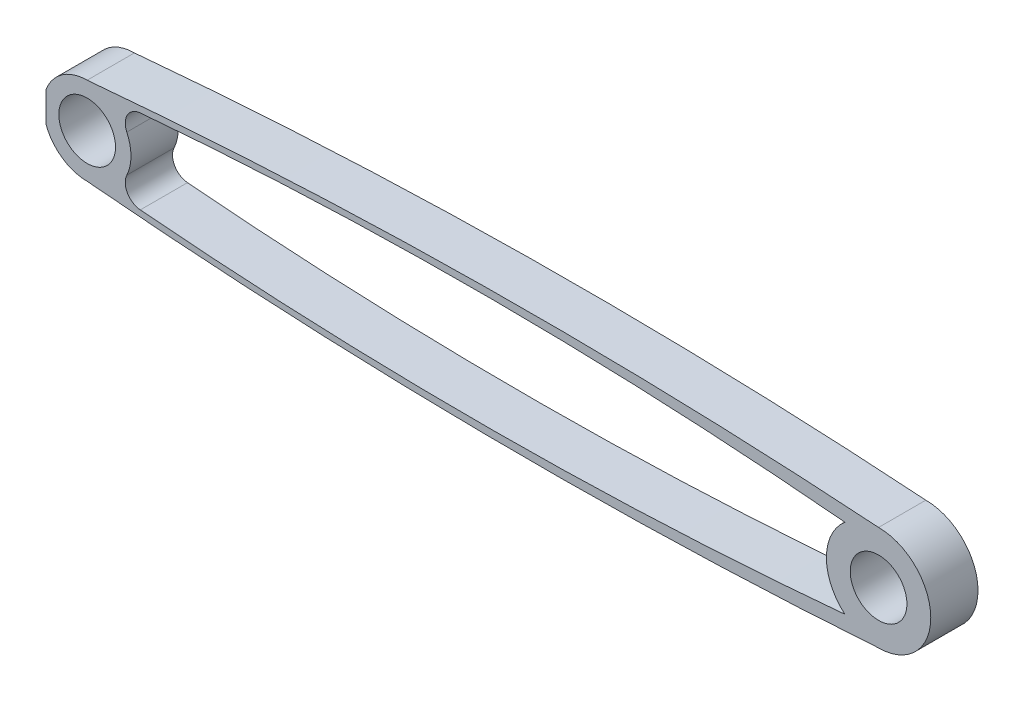
ISO-10303-21;
HEADER;
FILE_DESCRIPTION(('STEP AP214'),'2;1');
FILE_NAME('part.step','',(''),(''),'','','');
FILE_SCHEMA(('AUTOMOTIVE_DESIGN { 1 0 10303 214 1 1 1 1 }'));
ENDSEC;
DATA;
#1=APPLICATION_CONTEXT('core data for automotive mechanical design processes');
#2=APPLICATION_PROTOCOL_DEFINITION('international standard','automotive_design',2000,#1);
#3=PRODUCT_CONTEXT('',#1,'mechanical');
#4=PRODUCT('Part','Part','',(#3));
#5=PRODUCT_RELATED_PRODUCT_CATEGORY('part','',(#4));
#6=PRODUCT_DEFINITION_FORMATION('','',#4);
#7=PRODUCT_DEFINITION_CONTEXT('part definition',#1,'design');
#8=PRODUCT_DEFINITION('design','',#6,#7);
#9=PRODUCT_DEFINITION_SHAPE('','',#8);
#10=(LENGTH_UNIT() NAMED_UNIT(*) SI_UNIT(.MILLI.,.METRE.));
#11=(NAMED_UNIT(*) PLANE_ANGLE_UNIT() SI_UNIT($,.RADIAN.));
#12=(NAMED_UNIT(*) SI_UNIT($,.STERADIAN.) SOLID_ANGLE_UNIT());
#13=UNCERTAINTY_MEASURE_WITH_UNIT(LENGTH_MEASURE(1.E-05),#10,'distance_accuracy_value','');
#14=(GEOMETRIC_REPRESENTATION_CONTEXT(3) GLOBAL_UNCERTAINTY_ASSIGNED_CONTEXT((#13)) GLOBAL_UNIT_ASSIGNED_CONTEXT((#10,
#11,#12)) REPRESENTATION_CONTEXT('',''));
#15=CARTESIAN_POINT('',(0.,0.,0.));
#16=DIRECTION('',(0.,0.,1.));
#17=DIRECTION('',(1.,0.,0.));
#18=AXIS2_PLACEMENT_3D('',#15,#16,#17);
#19=CARTESIAN_POINT('',(0.,0.,5.));
#20=DIRECTION('',(0.,0.,-1.));
#21=DIRECTION('',(-1.,0.,0.));
#22=AXIS2_PLACEMENT_3D('',#19,#20,#21);
#23=CYLINDRICAL_SURFACE('',#22,4.63518821296482);
#24=DIRECTION('',(0.,0.,-1.));
#25=VECTOR('',#24,1.);
#26=CARTESIAN_POINT('',(-4.35681947691644,1.58211687784739,5.));
#27=LINE('',#26,#25);
#28=CARTESIAN_POINT('',(-4.35681947691644,1.58211687784739,5.));
#29=VERTEX_POINT('',#28);
#30=CARTESIAN_POINT('',(-4.35681947691644,1.58211687784739,0.));
#31=VERTEX_POINT('',#30);
#32=EDGE_CURVE('E51',#29,#31,#27,.T.);
#33=ORIENTED_EDGE('',*,*,#32,.F.);
#34=CARTESIAN_POINT('',(0.,0.,5.));
#35=DIRECTION('',(0.,0.,1.));
#36=DIRECTION('',(1.,0.,0.));
#37=AXIS2_PLACEMENT_3D('',#34,#35,#36);
#38=CIRCLE('',#37,4.63518821296482);
#39=CARTESIAN_POINT('',(3.32958487170298E-13,4.63518821296482,5.));
#40=VERTEX_POINT('',#39);
#41=EDGE_CURVE('E135',#40,#29,#38,.T.);
#42=ORIENTED_EDGE('',*,*,#41,.F.);
#43=DIRECTION('',(0.,0.,-1.));
#44=VECTOR('',#43,1.);
#45=CARTESIAN_POINT('',(3.32958487170298E-13,4.63518821296482,5.));
#46=LINE('',#45,#44);
#47=CARTESIAN_POINT('',(3.32958487170298E-13,4.63518821296482,0.));
#48=VERTEX_POINT('',#47);
#49=EDGE_CURVE('E144',#40,#48,#46,.T.);
#50=ORIENTED_EDGE('',*,*,#49,.T.);
#51=CARTESIAN_POINT('',(0.,0.,0.));
#52=DIRECTION('',(0.,0.,1.));
#53=DIRECTION('',(1.,0.,0.));
#54=AXIS2_PLACEMENT_3D('',#51,#52,#53);
#55=CIRCLE('',#54,4.63518821296482);
#56=EDGE_CURVE('E231',#48,#31,#55,.T.);
#57=ORIENTED_EDGE('',*,*,#56,.T.);
#58=EDGE_LOOP('',(#33,#42,#50,#57));
#59=FACE_BOUND('',#58,.T.);
#60=ADVANCED_FACE('F37',(#59),#23,.T.);
#61=DIRECTION('',(0.,0.,-1.));
#62=VECTOR('',#61,1.);
#63=CARTESIAN_POINT('',(-4.35681947691644,-1.58211687784739,5.));
#64=LINE('',#63,#62);
#65=CARTESIAN_POINT('',(-4.35681947691644,-1.58211687784739,0.));
#66=VERTEX_POINT('',#65);
#67=CARTESIAN_POINT('',(-4.35681947691644,-1.58211687784739,5.));
#68=VERTEX_POINT('',#67);
#69=EDGE_CURVE('E172',#66,#68,#64,.F.);
#70=ORIENTED_EDGE('',*,*,#69,.F.);
#71=CARTESIAN_POINT('',(3.32958487170298E-13,-4.63518821296482,0.));
#72=VERTEX_POINT('',#71);
#73=EDGE_CURVE('E186',#66,#72,#55,.T.);
#74=ORIENTED_EDGE('',*,*,#73,.T.);
#75=DIRECTION('',(0.,0.,-1.));
#76=VECTOR('',#75,1.);
#77=CARTESIAN_POINT('',(3.32958487170298E-13,-4.63518821296482,5.));
#78=LINE('',#77,#76);
#79=CARTESIAN_POINT('',(3.32958487170298E-13,-4.63518821296482,5.));
#80=VERTEX_POINT('',#79);
#81=EDGE_CURVE('E150',#80,#72,#78,.T.);
#82=ORIENTED_EDGE('',*,*,#81,.F.);
#83=EDGE_CURVE('E141',#68,#80,#38,.T.);
#84=ORIENTED_EDGE('',*,*,#83,.F.);
#85=EDGE_LOOP('',(#70,#74,#82,#84));
#86=FACE_BOUND('',#85,.T.);
#87=ADVANCED_FACE('F183',(#86),#23,.T.);
#88=CARTESIAN_POINT('',(0.,0.,5.));
#89=DIRECTION('',(0.,0.,1.));
#90=DIRECTION('',(1.,0.,0.));
#91=AXIS2_PLACEMENT_3D('',#88,#89,#90);
#92=PLANE('',#91);
#93=CARTESIAN_POINT('',(5.76774689859277,-2.71315004492879,5.));
#94=DIRECTION('',(0.,0.,1.));
#95=DIRECTION('',(1.,0.,0.));
#96=AXIS2_PLACEMENT_3D('',#93,#94,#95);
#97=CIRCLE('',#96,1.73882837412714);
#98=CARTESIAN_POINT('',(4.19430857677118,-1.97300413897988,5.));
#99=VERTEX_POINT('',#98);
#100=CARTESIAN_POINT('',(5.61931180938929,-4.44563125376274,5.));
#101=VERTEX_POINT('',#100);
#102=EDGE_CURVE('E160',#99,#101,#97,.T.);
#103=ORIENTED_EDGE('',*,*,#102,.F.);
#104=CARTESIAN_POINT('',(4.19430857677118,1.97300413897988,5.));
#105=VERTEX_POINT('',#104);
#106=EDGE_CURVE('E154',#99,#105,#38,.T.);
#107=ORIENTED_EDGE('',*,*,#106,.T.);
#108=CARTESIAN_POINT('',(5.76774689859277,2.71315004492879,5.));
#109=DIRECTION('',(0.,0.,1.));
#110=DIRECTION('',(1.,0.,0.));
#111=AXIS2_PLACEMENT_3D('',#108,#109,#110);
#112=CIRCLE('',#111,1.73882837412714);
#113=CARTESIAN_POINT('',(5.61931180938929,4.44563125376274,5.));
#114=VERTEX_POINT('',#113);
#115=EDGE_CURVE('E159',#105,#114,#112,.F.);
#116=ORIENTED_EDGE('',*,*,#115,.T.);
#117=CARTESIAN_POINT('',(41.6354176613858,-415.921459430747,5.));
#118=DIRECTION('',(0.,0.,1.));
#119=DIRECTION('',(1.,0.,0.));
#120=AXIS2_PLACEMENT_3D('',#117,#118,#119);
#121=CIRCLE('',#120,421.907158995081);
#122=CARTESIAN_POINT('',(80.1994463124824,4.21954845291396,5.));
#123=VERTEX_POINT('',#122);
#124=EDGE_CURVE('E164',#123,#114,#121,.T.);
#125=ORIENTED_EDGE('',*,*,#124,.F.);
#126=CARTESIAN_POINT('',(83.76241555,0.,5.));
#127=DIRECTION('',(0.,0.,1.));
#128=DIRECTION('',(1.,0.,0.));
#129=AXIS2_PLACEMENT_3D('',#126,#127,#128);
#130=CIRCLE('',#129,5.52262065816451);
#131=CARTESIAN_POINT('',(80.1994463124824,-4.21954845291396,5.));
#132=VERTEX_POINT('',#131);
#133=EDGE_CURVE('E270',#123,#132,#130,.T.);
#134=ORIENTED_EDGE('',*,*,#133,.T.);
#135=CARTESIAN_POINT('',(41.6354176613858,415.921459430747,5.));
#136=DIRECTION('',(0.,0.,1.));
#137=DIRECTION('',(1.,0.,0.));
#138=AXIS2_PLACEMENT_3D('',#135,#136,#137);
#139=CIRCLE('',#138,421.907158995081);
#140=EDGE_CURVE('E272',#132,#101,#139,.F.);
#141=ORIENTED_EDGE('',*,*,#140,.T.);
#142=EDGE_LOOP('',(#103,#107,#116,#125,#134,#141));
#143=FACE_BOUND('',#142,.T.);
#144=CARTESIAN_POINT('',(83.76241555,0.,5.));
#145=DIRECTION('',(0.,0.,1.));
#146=DIRECTION('',(1.,0.,0.));
#147=AXIS2_PLACEMENT_3D('',#144,#145,#146);
#148=CIRCLE('',#147,3.00000007924962);
#149=CARTESIAN_POINT('',(86.7624156292496,0.,5.));
#150=VERTEX_POINT('',#149);
#151=EDGE_CURVE('E276',#150,#150,#148,.T.);
#152=ORIENTED_EDGE('',*,*,#151,.F.);
#153=EDGE_LOOP('',(#152));
#154=FACE_BOUND('',#153,.T.);
#155=CARTESIAN_POINT('',(0.,0.,5.));
#156=DIRECTION('',(0.,0.,1.));
#157=DIRECTION('',(1.,0.,0.));
#158=AXIS2_PLACEMENT_3D('',#155,#156,#157);
#159=CIRCLE('',#158,3.00000007924961);
#160=CARTESIAN_POINT('',(3.00000007924961,0.,5.));
#161=VERTEX_POINT('',#160);
#162=EDGE_CURVE('E155',#161,#161,#159,.T.);
#163=ORIENTED_EDGE('',*,*,#162,.F.);
#164=EDGE_LOOP('',(#163));
#165=FACE_BOUND('',#164,.T.);
#166=ORIENTED_EDGE('',*,*,#41,.T.);
#167=DIRECTION('',(0.,1.,0.));
#168=VECTOR('',#167,1.);
#169=CARTESIAN_POINT('',(-4.35681947691644,0.,5.));
#170=LINE('',#169,#168);
#171=EDGE_CURVE('E175',#68,#29,#170,.T.);
#172=ORIENTED_EDGE('',*,*,#171,.F.);
#173=ORIENTED_EDGE('',*,*,#83,.T.);
#174=CARTESIAN_POINT('',(47.4249761200302,518.182815756402,5.));
#175=DIRECTION('',(0.,0.,1.));
#176=DIRECTION('',(1.,0.,0.));
#177=AXIS2_PLACEMENT_3D('',#174,#175,#176);
#178=CIRCLE('',#177,524.964564170287);
#179=CARTESIAN_POINT('',(83.7624155500015,-5.52262065816451,5.));
#180=VERTEX_POINT('',#179);
#181=EDGE_CURVE('E152',#180,#80,#178,.F.);
#182=ORIENTED_EDGE('',*,*,#181,.F.);
#183=CARTESIAN_POINT('',(83.7624155500015,5.52262065816451,5.));
#184=VERTEX_POINT('',#183);
#185=EDGE_CURVE('E137',#180,#184,#130,.T.);
#186=ORIENTED_EDGE('',*,*,#185,.T.);
#187=CARTESIAN_POINT('',(47.4249761200302,-518.182815756402,5.));
#188=DIRECTION('',(0.,0.,1.));
#189=DIRECTION('',(1.,0.,0.));
#190=AXIS2_PLACEMENT_3D('',#187,#188,#189);
#191=CIRCLE('',#190,524.964564170287);
#192=EDGE_CURVE('E130',#184,#40,#191,.T.);
#193=ORIENTED_EDGE('',*,*,#192,.T.);
#194=EDGE_LOOP('',(#166,#172,#173,#182,#186,#193));
#195=FACE_BOUND('',#194,.T.);
#196=ADVANCED_FACE('F132',(#143,#154,#165,#195),#92,.T.);
#197=CARTESIAN_POINT('',(0.,0.,0.));
#198=DIRECTION('',(0.,0.,1.));
#199=DIRECTION('',(1.,0.,0.));
#200=AXIS2_PLACEMENT_3D('',#197,#198,#199);
#201=PLANE('',#200);
#202=CARTESIAN_POINT('',(0.,0.,0.));
#203=DIRECTION('',(0.,0.,1.));
#204=DIRECTION('',(1.,0.,0.));
#205=AXIS2_PLACEMENT_3D('',#202,#203,#204);
#206=CIRCLE('',#205,3.00000007924961);
#207=CARTESIAN_POINT('',(3.00000007924961,0.,0.));
#208=VERTEX_POINT('',#207);
#209=EDGE_CURVE('E165',#208,#208,#206,.T.);
#210=ORIENTED_EDGE('',*,*,#209,.T.);
#211=EDGE_LOOP('',(#210));
#212=FACE_BOUND('',#211,.T.);
#213=CARTESIAN_POINT('',(83.76241555,0.,0.));
#214=DIRECTION('',(0.,0.,1.));
#215=DIRECTION('',(1.,0.,0.));
#216=AXIS2_PLACEMENT_3D('',#213,#214,#215);
#217=CIRCLE('',#216,3.00000007924962);
#218=CARTESIAN_POINT('',(86.7624156292496,0.,0.));
#219=VERTEX_POINT('',#218);
#220=EDGE_CURVE('E252',#219,#219,#217,.T.);
#221=ORIENTED_EDGE('',*,*,#220,.T.);
#222=EDGE_LOOP('',(#221));
#223=FACE_BOUND('',#222,.T.);
#224=CARTESIAN_POINT('',(5.76774689859277,-2.71315004492879,0.));
#225=DIRECTION('',(0.,0.,1.));
#226=DIRECTION('',(1.,0.,0.));
#227=AXIS2_PLACEMENT_3D('',#224,#225,#226);
#228=CIRCLE('',#227,1.73882837412714);
#229=CARTESIAN_POINT('',(4.19430857677118,-1.97300413897988,0.));
#230=VERTEX_POINT('',#229);
#231=CARTESIAN_POINT('',(5.61931180938929,-4.44563125376274,0.));
#232=VERTEX_POINT('',#231);
#233=EDGE_CURVE('E171',#230,#232,#228,.T.);
#234=ORIENTED_EDGE('',*,*,#233,.T.);
#235=CARTESIAN_POINT('',(41.6354176613858,415.921459430747,0.));
#236=DIRECTION('',(0.,0.,1.));
#237=DIRECTION('',(1.,0.,0.));
#238=AXIS2_PLACEMENT_3D('',#235,#236,#237);
#239=CIRCLE('',#238,421.907158995081);
#240=CARTESIAN_POINT('',(80.1994463124824,-4.21954845291396,0.));
#241=VERTEX_POINT('',#240);
#242=EDGE_CURVE('E248',#241,#232,#239,.F.);
#243=ORIENTED_EDGE('',*,*,#242,.F.);
#244=CARTESIAN_POINT('',(83.76241555,0.,0.));
#245=DIRECTION('',(0.,0.,1.));
#246=DIRECTION('',(1.,0.,0.));
#247=AXIS2_PLACEMENT_3D('',#244,#245,#246);
#248=CIRCLE('',#247,5.52262065816451);
#249=CARTESIAN_POINT('',(80.1994463124824,4.21954845291396,0.));
#250=VERTEX_POINT('',#249);
#251=EDGE_CURVE('E243',#250,#241,#248,.T.);
#252=ORIENTED_EDGE('',*,*,#251,.F.);
#253=CARTESIAN_POINT('',(41.6354176613858,-415.921459430747,0.));
#254=DIRECTION('',(0.,0.,1.));
#255=DIRECTION('',(1.,0.,0.));
#256=AXIS2_PLACEMENT_3D('',#253,#254,#255);
#257=CIRCLE('',#256,421.907158995081);
#258=CARTESIAN_POINT('',(5.61931180938929,4.44563125376274,0.));
#259=VERTEX_POINT('',#258);
#260=EDGE_CURVE('E241',#250,#259,#257,.T.);
#261=ORIENTED_EDGE('',*,*,#260,.T.);
#262=CARTESIAN_POINT('',(5.76774689859277,2.71315004492879,0.));
#263=DIRECTION('',(0.,0.,1.));
#264=DIRECTION('',(1.,0.,0.));
#265=AXIS2_PLACEMENT_3D('',#262,#263,#264);
#266=CIRCLE('',#265,1.73882837412714);
#267=CARTESIAN_POINT('',(4.19430857677118,1.97300413897988,0.));
#268=VERTEX_POINT('',#267);
#269=EDGE_CURVE('E229',#268,#259,#266,.F.);
#270=ORIENTED_EDGE('',*,*,#269,.F.);
#271=EDGE_CURVE('E222',#230,#268,#55,.T.);
#272=ORIENTED_EDGE('',*,*,#271,.F.);
#273=EDGE_LOOP('',(#234,#243,#252,#261,#270,#272));
#274=FACE_BOUND('',#273,.T.);
#275=DIRECTION('',(0.,-1.,0.));
#276=VECTOR('',#275,1.);
#277=CARTESIAN_POINT('',(-4.35681947691644,0.,0.));
#278=LINE('',#277,#276);
#279=EDGE_CURVE('E11',#31,#66,#278,.T.);
#280=ORIENTED_EDGE('',*,*,#279,.F.);
#281=ORIENTED_EDGE('',*,*,#56,.F.);
#282=CARTESIAN_POINT('',(47.4249761200302,-518.182815756402,0.));
#283=DIRECTION('',(0.,0.,1.));
#284=DIRECTION('',(1.,0.,0.));
#285=AXIS2_PLACEMENT_3D('',#282,#283,#284);
#286=CIRCLE('',#285,524.964564170287);
#287=CARTESIAN_POINT('',(83.7624155500015,5.52262065816451,0.));
#288=VERTEX_POINT('',#287);
#289=EDGE_CURVE('E146',#288,#48,#286,.T.);
#290=ORIENTED_EDGE('',*,*,#289,.F.);
#291=CARTESIAN_POINT('',(83.7624155500015,-5.52262065816451,0.));
#292=VERTEX_POINT('',#291);
#293=EDGE_CURVE('E249',#292,#288,#248,.T.);
#294=ORIENTED_EDGE('',*,*,#293,.F.);
#295=CARTESIAN_POINT('',(47.4249761200302,518.182815756402,0.));
#296=DIRECTION('',(0.,0.,1.));
#297=DIRECTION('',(1.,0.,0.));
#298=AXIS2_PLACEMENT_3D('',#295,#296,#297);
#299=CIRCLE('',#298,524.964564170287);
#300=EDGE_CURVE('E167',#292,#72,#299,.F.);
#301=ORIENTED_EDGE('',*,*,#300,.T.);
#302=ORIENTED_EDGE('',*,*,#73,.F.);
#303=EDGE_LOOP('',(#280,#281,#290,#294,#301,#302));
#304=FACE_BOUND('',#303,.T.);
#305=ADVANCED_FACE('F237',(#212,#223,#274,#304),#201,.F.);
#306=CARTESIAN_POINT('',(83.76241555,0.,5.));
#307=DIRECTION('',(0.,0.,-1.));
#308=DIRECTION('',(-1.,0.,0.));
#309=AXIS2_PLACEMENT_3D('',#306,#307,#308);
#310=CYLINDRICAL_SURFACE('',#309,5.52262065816451);
#311=ORIENTED_EDGE('',*,*,#293,.T.);
#312=DIRECTION('',(0.,0.,-1.));
#313=VECTOR('',#312,1.);
#314=CARTESIAN_POINT('',(83.7624155500015,5.52262065816451,5.));
#315=LINE('',#314,#313);
#316=EDGE_CURVE('E45',#184,#288,#315,.T.);
#317=ORIENTED_EDGE('',*,*,#316,.F.);
#318=ORIENTED_EDGE('',*,*,#185,.F.);
#319=DIRECTION('',(0.,0.,-1.));
#320=VECTOR('',#319,1.);
#321=CARTESIAN_POINT('',(83.7624155500015,-5.52262065816451,5.));
#322=LINE('',#321,#320);
#323=EDGE_CURVE('E60',#180,#292,#322,.T.);
#324=ORIENTED_EDGE('',*,*,#323,.T.);
#325=EDGE_LOOP('',(#311,#317,#318,#324));
#326=FACE_BOUND('',#325,.T.);
#327=ADVANCED_FACE('F204',(#326),#310,.T.);
#328=CARTESIAN_POINT('',(47.4249761200302,-518.182815756402,5.));
#329=DIRECTION('',(0.,0.,-1.));
#330=DIRECTION('',(-1.,0.,0.));
#331=AXIS2_PLACEMENT_3D('',#328,#329,#330);
#332=CYLINDRICAL_SURFACE('',#331,524.964564170287);
#333=ORIENTED_EDGE('',*,*,#289,.T.);
#334=ORIENTED_EDGE('',*,*,#49,.F.);
#335=ORIENTED_EDGE('',*,*,#192,.F.);
#336=ORIENTED_EDGE('',*,*,#316,.T.);
#337=EDGE_LOOP('',(#333,#334,#335,#336));
#338=FACE_BOUND('',#337,.T.);
#339=ADVANCED_FACE('F145',(#338),#332,.T.);
#340=CARTESIAN_POINT('',(5.76774689859277,-2.71315004492879,5.));
#341=DIRECTION('',(0.,0.,-1.));
#342=DIRECTION('',(-1.,0.,0.));
#343=AXIS2_PLACEMENT_3D('',#340,#341,#342);
#344=CYLINDRICAL_SURFACE('',#343,1.73882837412714);
#345=ORIENTED_EDGE('',*,*,#233,.F.);
#346=DIRECTION('',(0.,0.,-1.));
#347=VECTOR('',#346,1.);
#348=CARTESIAN_POINT('',(4.19430857677118,-1.97300413897988,5.));
#349=LINE('',#348,#347);
#350=EDGE_CURVE('E105',#99,#230,#349,.T.);
#351=ORIENTED_EDGE('',*,*,#350,.F.);
#352=ORIENTED_EDGE('',*,*,#102,.T.);
#353=DIRECTION('',(0.,0.,-1.));
#354=VECTOR('',#353,1.);
#355=CARTESIAN_POINT('',(5.61931180938929,-4.44563125376274,5.));
#356=LINE('',#355,#354);
#357=EDGE_CURVE('E259',#101,#232,#356,.T.);
#358=ORIENTED_EDGE('',*,*,#357,.T.);
#359=EDGE_LOOP('',(#345,#351,#352,#358));
#360=FACE_BOUND('',#359,.T.);
#361=ADVANCED_FACE('F39',(#360),#344,.F.);
#362=ORIENTED_EDGE('',*,*,#271,.T.);
#363=DIRECTION('',(0.,0.,-1.));
#364=VECTOR('',#363,1.);
#365=CARTESIAN_POINT('',(4.19430857677118,1.97300413897988,5.));
#366=LINE('',#365,#364);
#367=EDGE_CURVE('E224',#105,#268,#366,.T.);
#368=ORIENTED_EDGE('',*,*,#367,.F.);
#369=ORIENTED_EDGE('',*,*,#106,.F.);
#370=ORIENTED_EDGE('',*,*,#350,.T.);
#371=EDGE_LOOP('',(#362,#368,#369,#370));
#372=FACE_BOUND('',#371,.T.);
#373=ADVANCED_FACE('F208',(#372),#23,.T.);
#374=CARTESIAN_POINT('',(5.76774689859277,2.71315004492879,5.));
#375=DIRECTION('',(0.,0.,-1.));
#376=DIRECTION('',(-1.,0.,0.));
#377=AXIS2_PLACEMENT_3D('',#374,#375,#376);
#378=CYLINDRICAL_SURFACE('',#377,1.73882837412714);
#379=ORIENTED_EDGE('',*,*,#269,.T.);
#380=DIRECTION('',(0.,0.,-1.));
#381=VECTOR('',#380,1.);
#382=CARTESIAN_POINT('',(5.61931180938929,4.44563125376274,5.));
#383=LINE('',#382,#381);
#384=EDGE_CURVE('E235',#114,#259,#383,.T.);
#385=ORIENTED_EDGE('',*,*,#384,.F.);
#386=ORIENTED_EDGE('',*,*,#115,.F.);
#387=ORIENTED_EDGE('',*,*,#367,.T.);
#388=EDGE_LOOP('',(#379,#385,#386,#387));
#389=FACE_BOUND('',#388,.T.);
#390=ADVANCED_FACE('F214',(#389),#378,.F.);
#391=CARTESIAN_POINT('',(41.6354176613858,-415.921459430747,5.));
#392=DIRECTION('',(0.,0.,-1.));
#393=DIRECTION('',(-1.,0.,0.));
#394=AXIS2_PLACEMENT_3D('',#391,#392,#393);
#395=CYLINDRICAL_SURFACE('',#394,421.907158995081);
#396=ORIENTED_EDGE('',*,*,#260,.F.);
#397=DIRECTION('',(0.,0.,-1.));
#398=VECTOR('',#397,1.);
#399=CARTESIAN_POINT('',(80.1994463124824,4.21954845291396,5.));
#400=LINE('',#399,#398);
#401=EDGE_CURVE('E264',#123,#250,#400,.T.);
#402=ORIENTED_EDGE('',*,*,#401,.F.);
#403=ORIENTED_EDGE('',*,*,#124,.T.);
#404=ORIENTED_EDGE('',*,*,#384,.T.);
#405=EDGE_LOOP('',(#396,#402,#403,#404));
#406=FACE_BOUND('',#405,.T.);
#407=ADVANCED_FACE('F201',(#406),#395,.F.);
#408=ORIENTED_EDGE('',*,*,#251,.T.);
#409=DIRECTION('',(0.,0.,-1.));
#410=VECTOR('',#409,1.);
#411=CARTESIAN_POINT('',(80.1994463124824,-4.21954845291396,5.));
#412=LINE('',#411,#410);
#413=EDGE_CURVE('E261',#132,#241,#412,.T.);
#414=ORIENTED_EDGE('',*,*,#413,.F.);
#415=ORIENTED_EDGE('',*,*,#133,.F.);
#416=ORIENTED_EDGE('',*,*,#401,.T.);
#417=EDGE_LOOP('',(#408,#414,#415,#416));
#418=FACE_BOUND('',#417,.T.);
#419=ADVANCED_FACE('F192',(#418),#310,.T.);
#420=CARTESIAN_POINT('',(47.4249761200302,518.182815756402,5.));
#421=DIRECTION('',(0.,0.,-1.));
#422=DIRECTION('',(-1.,0.,0.));
#423=AXIS2_PLACEMENT_3D('',#420,#421,#422);
#424=CYLINDRICAL_SURFACE('',#423,524.964564170287);
#425=ORIENTED_EDGE('',*,*,#300,.F.);
#426=ORIENTED_EDGE('',*,*,#323,.F.);
#427=ORIENTED_EDGE('',*,*,#181,.T.);
#428=ORIENTED_EDGE('',*,*,#81,.T.);
#429=EDGE_LOOP('',(#425,#426,#427,#428));
#430=FACE_BOUND('',#429,.T.);
#431=ADVANCED_FACE('F189',(#430),#424,.T.);
#432=CARTESIAN_POINT('',(83.76241555,0.,5.));
#433=DIRECTION('',(0.,0.,-1.));
#434=DIRECTION('',(-1.,0.,0.));
#435=AXIS2_PLACEMENT_3D('',#432,#433,#434);
#436=CYLINDRICAL_SURFACE('',#435,3.00000007924962);
#437=ORIENTED_EDGE('',*,*,#151,.T.);
#438=EDGE_LOOP('',(#437));
#439=FACE_BOUND('',#438,.T.);
#440=ORIENTED_EDGE('',*,*,#220,.F.);
#441=EDGE_LOOP('',(#440));
#442=FACE_BOUND('',#441,.T.);
#443=ADVANCED_FACE('F191',(#439,#442),#436,.F.);
#444=CARTESIAN_POINT('',(41.6354176613858,415.921459430747,5.));
#445=DIRECTION('',(0.,0.,-1.));
#446=DIRECTION('',(-1.,0.,0.));
#447=AXIS2_PLACEMENT_3D('',#444,#445,#446);
#448=CYLINDRICAL_SURFACE('',#447,421.907158995081);
#449=ORIENTED_EDGE('',*,*,#242,.T.);
#450=ORIENTED_EDGE('',*,*,#357,.F.);
#451=ORIENTED_EDGE('',*,*,#140,.F.);
#452=ORIENTED_EDGE('',*,*,#413,.T.);
#453=EDGE_LOOP('',(#449,#450,#451,#452));
#454=FACE_BOUND('',#453,.T.);
#455=ADVANCED_FACE('F198',(#454),#448,.F.);
#456=CARTESIAN_POINT('',(0.,0.,5.));
#457=DIRECTION('',(0.,0.,-1.));
#458=DIRECTION('',(-1.,0.,0.));
#459=AXIS2_PLACEMENT_3D('',#456,#457,#458);
#460=CYLINDRICAL_SURFACE('',#459,3.00000007924961);
#461=ORIENTED_EDGE('',*,*,#162,.T.);
#462=EDGE_LOOP('',(#461));
#463=FACE_BOUND('',#462,.T.);
#464=ORIENTED_EDGE('',*,*,#209,.F.);
#465=EDGE_LOOP('',(#464));
#466=FACE_BOUND('',#465,.T.);
#467=ADVANCED_FACE('F292',(#463,#466),#460,.F.);
#468=CARTESIAN_POINT('',(-4.35681947691644,0.,5.));
#469=DIRECTION('',(-1.,0.,0.));
#470=DIRECTION('',(0.,0.,1.));
#471=AXIS2_PLACEMENT_3D('',#468,#469,#470);
#472=PLANE('',#471);
#473=ORIENTED_EDGE('',*,*,#32,.T.);
#474=ORIENTED_EDGE('',*,*,#279,.T.);
#475=ORIENTED_EDGE('',*,*,#69,.T.);
#476=ORIENTED_EDGE('',*,*,#171,.T.);
#477=EDGE_LOOP('',(#473,#474,#475,#476));
#478=FACE_BOUND('',#477,.T.);
#479=ADVANCED_FACE('F176',(#478),#472,.T.);
#480=CLOSED_SHELL('',(#60,#87,#196,#305,#327,#339,#361,#373,#390,#407,#419,#431,#443,#455,#467,#479));
#481=MANIFOLD_SOLID_BREP('B2',#480);
#482=ADVANCED_BREP_SHAPE_REPRESENTATION('',(#18,#481),#14);
#483=SHAPE_DEFINITION_REPRESENTATION(#9,#482);
ENDSEC;
END-ISO-10303-21;
